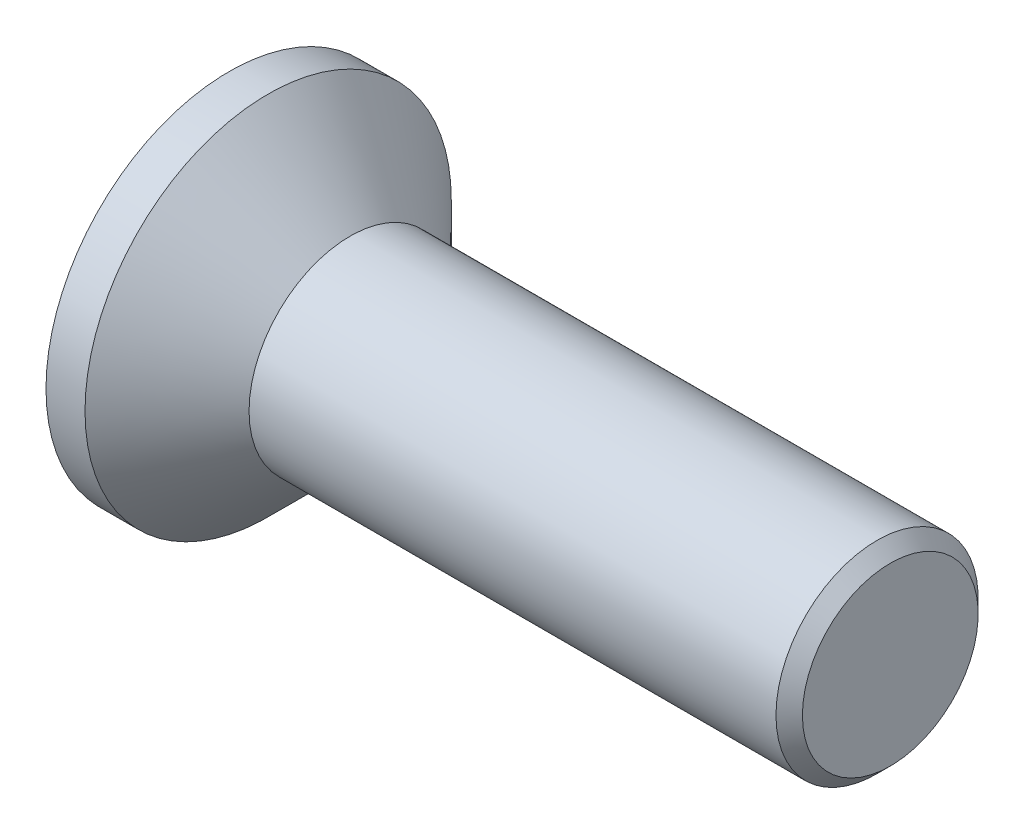
ISO-10303-21;
HEADER;
FILE_DESCRIPTION(('STEP AP214'),'2;1');
FILE_NAME('part.step','',(''),(''),'','','');
FILE_SCHEMA(('AUTOMOTIVE_DESIGN { 1 0 10303 214 1 1 1 1 }'));
ENDSEC;
DATA;
#1=APPLICATION_CONTEXT('core data for automotive mechanical design processes');
#2=APPLICATION_PROTOCOL_DEFINITION('international standard','automotive_design',2000,#1);
#3=PRODUCT_CONTEXT('',#1,'mechanical');
#4=PRODUCT('Part','Part','',(#3));
#5=PRODUCT_RELATED_PRODUCT_CATEGORY('part','',(#4));
#6=PRODUCT_DEFINITION_FORMATION('','',#4);
#7=PRODUCT_DEFINITION_CONTEXT('part definition',#1,'design');
#8=PRODUCT_DEFINITION('design','',#6,#7);
#9=PRODUCT_DEFINITION_SHAPE('','',#8);
#10=(LENGTH_UNIT() NAMED_UNIT(*) SI_UNIT(.MILLI.,.METRE.));
#11=(NAMED_UNIT(*) PLANE_ANGLE_UNIT() SI_UNIT($,.RADIAN.));
#12=(NAMED_UNIT(*) SI_UNIT($,.STERADIAN.) SOLID_ANGLE_UNIT());
#13=UNCERTAINTY_MEASURE_WITH_UNIT(LENGTH_MEASURE(1.E-05),#10,'distance_accuracy_value','');
#14=(GEOMETRIC_REPRESENTATION_CONTEXT(3) GLOBAL_UNCERTAINTY_ASSIGNED_CONTEXT((#13)) GLOBAL_UNIT_ASSIGNED_CONTEXT((#10,
#11,#12)) REPRESENTATION_CONTEXT('',''));
#15=CARTESIAN_POINT('',(0.,0.,0.));
#16=DIRECTION('',(0.,0.,1.));
#17=DIRECTION('',(1.,0.,0.));
#18=AXIS2_PLACEMENT_3D('',#15,#16,#17);
#19=CARTESIAN_POINT('',(1.09999999999999,0.,0.));
#20=DIRECTION('',(-1.,0.,0.));
#21=DIRECTION('',(0.,0.,1.));
#22=AXIS2_PLACEMENT_3D('',#19,#20,#21);
#23=CONICAL_SURFACE('',#22,0.99999999999989,1.04719755119658);
#24=CARTESIAN_POINT('',(1.67735026918958,0.,0.));
#25=VERTEX_POINT('',#24);
#26=VERTEX_LOOP('',#25);
#27=FACE_BOUND('',#26,.T.);
#28=CARTESIAN_POINT('',(1.09999999999999,0.,0.));
#29=DIRECTION('',(-1.,0.,0.));
#30=DIRECTION('',(0.,0.,1.));
#31=AXIS2_PLACEMENT_3D('',#28,#29,#30);
#32=CIRCLE('',#31,0.99999999999989);
#33=CARTESIAN_POINT('',(1.09999999999999,-0.499999999999972,0.86602540378439));
#34=VERTEX_POINT('',#33);
#35=CARTESIAN_POINT('',(1.09999999999999,0.499999999999972,0.866025403784391));
#36=VERTEX_POINT('',#35);
#37=EDGE_CURVE('E91',#34,#36,#32,.T.);
#38=ORIENTED_EDGE('',*,*,#37,.T.);
#39=CARTESIAN_POINT('',(1.09999999999999,0.,0.));
#40=DIRECTION('',(-1.,0.,0.));
#41=DIRECTION('',(0.,0.,1.));
#42=AXIS2_PLACEMENT_3D('',#39,#40,#41);
#43=CIRCLE('',#42,0.99999999999989);
#44=CARTESIAN_POINT('',(1.09999999999999,0.999999999999945,0.));
#45=VERTEX_POINT('',#44);
#46=EDGE_CURVE('E105',#36,#45,#43,.T.);
#47=ORIENTED_EDGE('',*,*,#46,.T.);
#48=CARTESIAN_POINT('',(1.09999999999999,0.,0.));
#49=DIRECTION('',(-1.,0.,0.));
#50=DIRECTION('',(0.,0.,1.));
#51=AXIS2_PLACEMENT_3D('',#48,#49,#50);
#52=CIRCLE('',#51,0.99999999999989);
#53=CARTESIAN_POINT('',(1.09999999999999,0.499999999999972,-0.866025403784391));
#54=VERTEX_POINT('',#53);
#55=EDGE_CURVE('E148',#45,#54,#52,.T.);
#56=ORIENTED_EDGE('',*,*,#55,.T.);
#57=CARTESIAN_POINT('',(1.09999999999999,0.,0.));
#58=DIRECTION('',(-1.,0.,0.));
#59=DIRECTION('',(0.,0.,1.));
#60=AXIS2_PLACEMENT_3D('',#57,#58,#59);
#61=CIRCLE('',#60,0.99999999999989);
#62=CARTESIAN_POINT('',(1.09999999999999,-0.499999999999973,-0.866025403784392));
#63=VERTEX_POINT('',#62);
#64=EDGE_CURVE('E135',#54,#63,#61,.T.);
#65=ORIENTED_EDGE('',*,*,#64,.T.);
#66=CARTESIAN_POINT('',(1.09999999999999,0.,0.));
#67=DIRECTION('',(-1.,0.,0.));
#68=DIRECTION('',(0.,0.,1.));
#69=AXIS2_PLACEMENT_3D('',#66,#67,#68);
#70=CIRCLE('',#69,0.99999999999989);
#71=CARTESIAN_POINT('',(1.09999999999999,-0.999999999999945,0.));
#72=VERTEX_POINT('',#71);
#73=EDGE_CURVE('E88',#63,#72,#70,.T.);
#74=ORIENTED_EDGE('',*,*,#73,.T.);
#75=CARTESIAN_POINT('',(1.09999999999999,0.,0.));
#76=DIRECTION('',(-1.,0.,0.));
#77=DIRECTION('',(0.,0.,1.));
#78=AXIS2_PLACEMENT_3D('',#75,#76,#77);
#79=CIRCLE('',#78,0.99999999999989);
#80=EDGE_CURVE('E19',#72,#34,#79,.T.);
#81=ORIENTED_EDGE('',*,*,#80,.T.);
#82=EDGE_LOOP('',(#38,#47,#56,#65,#74,#81));
#83=FACE_BOUND('',#82,.T.);
#84=ADVANCED_FACE('F16',(#27,#83),#23,.F.);
#85=CARTESIAN_POINT('',(1.1,0.,-1.15470053837925));
#86=DIRECTION('',(1.,0.,0.));
#87=DIRECTION('',(0.,0.,-1.));
#88=AXIS2_PLACEMENT_3D('',#85,#86,#87);
#89=PLANE('',#88);
#90=DIRECTION('',(0.,0.,1.));
#91=VECTOR('',#90,1.);
#92=CARTESIAN_POINT('',(1.1,-1.,0.577350269189625));
#93=LINE('',#92,#91);
#94=CARTESIAN_POINT('',(1.1,-1.,0.577350269189624));
#95=VERTEX_POINT('',#94);
#96=EDGE_CURVE('E110',#95,#72,#93,.F.);
#97=ORIENTED_EDGE('',*,*,#96,.F.);
#98=DIRECTION('',(0.,0.866025403784439,0.5));
#99=VECTOR('',#98,1.);
#100=CARTESIAN_POINT('',(1.1,0.,1.15470053837925));
#101=LINE('',#100,#99);
#102=EDGE_CURVE('E107',#34,#95,#101,.F.);
#103=ORIENTED_EDGE('',*,*,#102,.F.);
#104=ORIENTED_EDGE('',*,*,#80,.F.);
#105=EDGE_LOOP('',(#97,#103,#104));
#106=FACE_BOUND('',#105,.T.);
#107=ADVANCED_FACE('F108',(#106),#89,.F.);
#108=CARTESIAN_POINT('',(1.1,0.,-1.15470053837925));
#109=DIRECTION('',(1.,0.,0.));
#110=DIRECTION('',(0.,0.,-1.));
#111=AXIS2_PLACEMENT_3D('',#108,#109,#110);
#112=PLANE('',#111);
#113=DIRECTION('',(0.,0.866025403784439,0.5));
#114=VECTOR('',#113,1.);
#115=CARTESIAN_POINT('',(1.1,0.,1.15470053837925));
#116=LINE('',#115,#114);
#117=CARTESIAN_POINT('',(1.1,0.,1.15470053837925));
#118=VERTEX_POINT('',#117);
#119=EDGE_CURVE('E100',#118,#34,#116,.F.);
#120=ORIENTED_EDGE('',*,*,#119,.F.);
#121=DIRECTION('',(0.,0.866025403784439,-0.5));
#122=VECTOR('',#121,1.);
#123=CARTESIAN_POINT('',(1.1,1.,0.577350269189625));
#124=LINE('',#123,#122);
#125=EDGE_CURVE('E103',#36,#118,#124,.F.);
#126=ORIENTED_EDGE('',*,*,#125,.F.);
#127=ORIENTED_EDGE('',*,*,#37,.F.);
#128=EDGE_LOOP('',(#120,#126,#127));
#129=FACE_BOUND('',#128,.T.);
#130=ADVANCED_FACE('F98',(#129),#112,.F.);
#131=CARTESIAN_POINT('',(1.1,0.,-1.15470053837925));
#132=DIRECTION('',(1.,0.,0.));
#133=DIRECTION('',(0.,0.,-1.));
#134=AXIS2_PLACEMENT_3D('',#131,#132,#133);
#135=PLANE('',#134);
#136=DIRECTION('',(0.,0.866025403784439,-0.5));
#137=VECTOR('',#136,1.);
#138=CARTESIAN_POINT('',(1.1,1.,0.577350269189625));
#139=LINE('',#138,#137);
#140=CARTESIAN_POINT('',(1.1,1.,0.577350269189625));
#141=VERTEX_POINT('',#140);
#142=EDGE_CURVE('E131',#141,#36,#139,.F.);
#143=ORIENTED_EDGE('',*,*,#142,.F.);
#144=DIRECTION('',(0.,0.,-1.));
#145=VECTOR('',#144,1.);
#146=CARTESIAN_POINT('',(1.1,1.,-0.577350269189625));
#147=LINE('',#146,#145);
#148=EDGE_CURVE('E164',#45,#141,#147,.F.);
#149=ORIENTED_EDGE('',*,*,#148,.F.);
#150=ORIENTED_EDGE('',*,*,#46,.F.);
#151=EDGE_LOOP('',(#143,#149,#150));
#152=FACE_BOUND('',#151,.T.);
#153=ADVANCED_FACE('F165',(#152),#135,.F.);
#154=CARTESIAN_POINT('',(1.1,0.,-1.15470053837925));
#155=DIRECTION('',(1.,0.,0.));
#156=DIRECTION('',(0.,0.,-1.));
#157=AXIS2_PLACEMENT_3D('',#154,#155,#156);
#158=PLANE('',#157);
#159=DIRECTION('',(0.,0.,-1.));
#160=VECTOR('',#159,1.);
#161=CARTESIAN_POINT('',(1.1,1.,-0.577350269189625));
#162=LINE('',#161,#160);
#163=CARTESIAN_POINT('',(1.1,1.,-0.577350269189625));
#164=VERTEX_POINT('',#163);
#165=EDGE_CURVE('E158',#164,#45,#162,.F.);
#166=ORIENTED_EDGE('',*,*,#165,.F.);
#167=DIRECTION('',(0.,-0.866025403784439,-0.5));
#168=VECTOR('',#167,1.);
#169=CARTESIAN_POINT('',(1.1,0.,-1.15470053837925));
#170=LINE('',#169,#168);
#171=EDGE_CURVE('E161',#54,#164,#170,.F.);
#172=ORIENTED_EDGE('',*,*,#171,.F.);
#173=ORIENTED_EDGE('',*,*,#55,.F.);
#174=EDGE_LOOP('',(#166,#172,#173));
#175=FACE_BOUND('',#174,.T.);
#176=ADVANCED_FACE('F156',(#175),#158,.F.);
#177=CARTESIAN_POINT('',(1.1,0.,-1.15470053837925));
#178=DIRECTION('',(1.,0.,0.));
#179=DIRECTION('',(0.,0.,-1.));
#180=AXIS2_PLACEMENT_3D('',#177,#178,#179);
#181=PLANE('',#180);
#182=DIRECTION('',(0.,-0.866025403784439,0.5));
#183=VECTOR('',#182,1.);
#184=CARTESIAN_POINT('',(1.1,-1.,-0.577350269189628));
#185=LINE('',#184,#183);
#186=CARTESIAN_POINT('',(1.1,-1.,-0.577350269189628));
#187=VERTEX_POINT('',#186);
#188=EDGE_CURVE('E210',#187,#63,#185,.F.);
#189=ORIENTED_EDGE('',*,*,#188,.F.);
#190=DIRECTION('',(0.,0.,1.));
#191=VECTOR('',#190,1.);
#192=CARTESIAN_POINT('',(1.1,-1.,0.577350269189625));
#193=LINE('',#192,#191);
#194=EDGE_CURVE('E119',#72,#187,#193,.F.);
#195=ORIENTED_EDGE('',*,*,#194,.F.);
#196=ORIENTED_EDGE('',*,*,#73,.F.);
#197=EDGE_LOOP('',(#189,#195,#196));
#198=FACE_BOUND('',#197,.T.);
#199=ADVANCED_FACE('F249',(#198),#181,.F.);
#200=CARTESIAN_POINT('',(1.1,0.,-1.15470053837925));
#201=DIRECTION('',(1.,0.,0.));
#202=DIRECTION('',(0.,0.,-1.));
#203=AXIS2_PLACEMENT_3D('',#200,#201,#202);
#204=PLANE('',#203);
#205=DIRECTION('',(0.,-0.866025403784439,-0.5));
#206=VECTOR('',#205,1.);
#207=CARTESIAN_POINT('',(1.1,0.,-1.15470053837925));
#208=LINE('',#207,#206);
#209=CARTESIAN_POINT('',(1.1,0.,-1.15470053837925));
#210=VERTEX_POINT('',#209);
#211=EDGE_CURVE('E183',#210,#54,#208,.F.);
#212=ORIENTED_EDGE('',*,*,#211,.F.);
#213=DIRECTION('',(0.,-0.866025403784439,0.5));
#214=VECTOR('',#213,1.);
#215=CARTESIAN_POINT('',(1.1,-1.,-0.577350269189628));
#216=LINE('',#215,#214);
#217=EDGE_CURVE('E213',#63,#210,#216,.F.);
#218=ORIENTED_EDGE('',*,*,#217,.F.);
#219=ORIENTED_EDGE('',*,*,#64,.F.);
#220=EDGE_LOOP('',(#212,#218,#219));
#221=FACE_BOUND('',#220,.T.);
#222=ADVANCED_FACE('F246',(#221),#204,.F.);
#223=CARTESIAN_POINT('',(1.1,-1.,0.577350269189625));
#224=DIRECTION('',(0.,1.,0.));
#225=DIRECTION('',(0.,0.,1.));
#226=AXIS2_PLACEMENT_3D('',#223,#224,#225);
#227=PLANE('',#226);
#228=ORIENTED_EDGE('',*,*,#194,.T.);
#229=DIRECTION('',(1.,0.,0.));
#230=VECTOR('',#229,1.);
#231=CARTESIAN_POINT('',(1.1,-1.,-0.577350269189628));
#232=LINE('',#231,#230);
#233=CARTESIAN_POINT('',(0.,-1.,-0.577350269189628));
#234=VERTEX_POINT('',#233);
#235=EDGE_CURVE('E214',#234,#187,#232,.T.);
#236=ORIENTED_EDGE('',*,*,#235,.F.);
#237=DIRECTION('',(0.,0.,-1.));
#238=VECTOR('',#237,1.);
#239=CARTESIAN_POINT('',(0.,-1.,0.));
#240=LINE('',#239,#238);
#241=CARTESIAN_POINT('',(0.,-1.,0.577350269189625));
#242=VERTEX_POINT('',#241);
#243=EDGE_CURVE('E209',#234,#242,#240,.F.);
#244=ORIENTED_EDGE('',*,*,#243,.T.);
#245=DIRECTION('',(1.,0.,0.));
#246=VECTOR('',#245,1.);
#247=CARTESIAN_POINT('',(1.1,-1.,0.577350269189624));
#248=LINE('',#247,#246);
#249=EDGE_CURVE('E114',#95,#242,#248,.F.);
#250=ORIENTED_EDGE('',*,*,#249,.F.);
#251=ORIENTED_EDGE('',*,*,#96,.T.);
#252=EDGE_LOOP('',(#228,#236,#244,#250,#251));
#253=FACE_BOUND('',#252,.T.);
#254=ADVANCED_FACE('F251',(#253),#227,.T.);
#255=CARTESIAN_POINT('',(1.1,0.,1.15470053837925));
#256=DIRECTION('',(0.,0.5,-0.866025403784439));
#257=DIRECTION('',(0.,0.866025403784439,0.5));
#258=AXIS2_PLACEMENT_3D('',#255,#256,#257);
#259=PLANE('',#258);
#260=ORIENTED_EDGE('',*,*,#102,.T.);
#261=ORIENTED_EDGE('',*,*,#249,.T.);
#262=DIRECTION('',(0.,0.866025403784439,0.499999999999999));
#263=VECTOR('',#262,1.);
#264=CARTESIAN_POINT('',(0.,-1.,0.577350269189625));
#265=LINE('',#264,#263);
#266=CARTESIAN_POINT('',(0.,0.,1.15470053837925));
#267=VERTEX_POINT('',#266);
#268=EDGE_CURVE('E204',#242,#267,#265,.T.);
#269=ORIENTED_EDGE('',*,*,#268,.T.);
#270=DIRECTION('',(1.,0.,0.));
#271=VECTOR('',#270,1.);
#272=CARTESIAN_POINT('',(1.1,0.,1.15470053837925));
#273=LINE('',#272,#271);
#274=EDGE_CURVE('E118',#118,#267,#273,.F.);
#275=ORIENTED_EDGE('',*,*,#274,.F.);
#276=ORIENTED_EDGE('',*,*,#119,.T.);
#277=EDGE_LOOP('',(#260,#261,#269,#275,#276));
#278=FACE_BOUND('',#277,.T.);
#279=ADVANCED_FACE('F116',(#278),#259,.T.);
#280=CARTESIAN_POINT('',(1.1,1.,0.577350269189625));
#281=DIRECTION('',(0.,-0.5,-0.866025403784439));
#282=DIRECTION('',(0.,0.866025403784439,-0.5));
#283=AXIS2_PLACEMENT_3D('',#280,#281,#282);
#284=PLANE('',#283);
#285=ORIENTED_EDGE('',*,*,#125,.T.);
#286=ORIENTED_EDGE('',*,*,#274,.T.);
#287=DIRECTION('',(0.,0.866025403784439,-0.5));
#288=VECTOR('',#287,1.);
#289=CARTESIAN_POINT('',(0.,0.,1.15470053837925));
#290=LINE('',#289,#288);
#291=CARTESIAN_POINT('',(0.,1.,0.577350269189625));
#292=VERTEX_POINT('',#291);
#293=EDGE_CURVE('E194',#267,#292,#290,.T.);
#294=ORIENTED_EDGE('',*,*,#293,.T.);
#295=DIRECTION('',(1.,0.,0.));
#296=VECTOR('',#295,1.);
#297=CARTESIAN_POINT('',(1.1,1.,0.577350269189625));
#298=LINE('',#297,#296);
#299=EDGE_CURVE('E169',#141,#292,#298,.F.);
#300=ORIENTED_EDGE('',*,*,#299,.F.);
#301=ORIENTED_EDGE('',*,*,#142,.T.);
#302=EDGE_LOOP('',(#285,#286,#294,#300,#301));
#303=FACE_BOUND('',#302,.T.);
#304=ADVANCED_FACE('F192',(#303),#284,.T.);
#305=CARTESIAN_POINT('',(1.1,1.,-0.577350269189625));
#306=DIRECTION('',(0.,-1.,0.));
#307=DIRECTION('',(0.,0.,-1.));
#308=AXIS2_PLACEMENT_3D('',#305,#306,#307);
#309=PLANE('',#308);
#310=ORIENTED_EDGE('',*,*,#148,.T.);
#311=ORIENTED_EDGE('',*,*,#299,.T.);
#312=DIRECTION('',(0.,0.,-1.));
#313=VECTOR('',#312,1.);
#314=CARTESIAN_POINT('',(0.,1.,0.));
#315=LINE('',#314,#313);
#316=CARTESIAN_POINT('',(0.,1.,-0.577350269189625));
#317=VERTEX_POINT('',#316);
#318=EDGE_CURVE('E196',#292,#317,#315,.T.);
#319=ORIENTED_EDGE('',*,*,#318,.T.);
#320=DIRECTION('',(1.,0.,0.));
#321=VECTOR('',#320,1.);
#322=CARTESIAN_POINT('',(1.1,1.,-0.577350269189626));
#323=LINE('',#322,#321);
#324=EDGE_CURVE('E172',#164,#317,#323,.F.);
#325=ORIENTED_EDGE('',*,*,#324,.F.);
#326=ORIENTED_EDGE('',*,*,#165,.T.);
#327=EDGE_LOOP('',(#310,#311,#319,#325,#326));
#328=FACE_BOUND('',#327,.T.);
#329=ADVANCED_FACE('F171',(#328),#309,.T.);
#330=CARTESIAN_POINT('',(1.1,0.,-1.15470053837925));
#331=DIRECTION('',(0.,-0.5,0.866025403784439));
#332=DIRECTION('',(0.,-0.866025403784439,-0.5));
#333=AXIS2_PLACEMENT_3D('',#330,#331,#332);
#334=PLANE('',#333);
#335=ORIENTED_EDGE('',*,*,#171,.T.);
#336=ORIENTED_EDGE('',*,*,#324,.T.);
#337=DIRECTION('',(0.,-0.866025403784438,-0.5));
#338=VECTOR('',#337,1.);
#339=CARTESIAN_POINT('',(0.,1.,-0.577350269189625));
#340=LINE('',#339,#338);
#341=CARTESIAN_POINT('',(0.,0.,-1.15470053837925));
#342=VERTEX_POINT('',#341);
#343=EDGE_CURVE('E34',#317,#342,#340,.T.);
#344=ORIENTED_EDGE('',*,*,#343,.T.);
#345=DIRECTION('',(1.,0.,0.));
#346=VECTOR('',#345,1.);
#347=CARTESIAN_POINT('',(1.1,0.,-1.15470053837925));
#348=LINE('',#347,#346);
#349=EDGE_CURVE('E219',#210,#342,#348,.F.);
#350=ORIENTED_EDGE('',*,*,#349,.F.);
#351=ORIENTED_EDGE('',*,*,#211,.T.);
#352=EDGE_LOOP('',(#335,#336,#344,#350,#351));
#353=FACE_BOUND('',#352,.T.);
#354=ADVANCED_FACE('F243',(#353),#334,.T.);
#355=CARTESIAN_POINT('',(1.1,-1.,-0.577350269189628));
#356=DIRECTION('',(0.,0.5,0.866025403784439));
#357=DIRECTION('',(0.,-0.866025403784439,0.5));
#358=AXIS2_PLACEMENT_3D('',#355,#356,#357);
#359=PLANE('',#358);
#360=ORIENTED_EDGE('',*,*,#217,.T.);
#361=ORIENTED_EDGE('',*,*,#349,.T.);
#362=DIRECTION('',(0.,-0.866025403784439,0.5));
#363=VECTOR('',#362,1.);
#364=CARTESIAN_POINT('',(0.,0.,-1.15470053837925));
#365=LINE('',#364,#363);
#366=EDGE_CURVE('E145',#342,#234,#365,.T.);
#367=ORIENTED_EDGE('',*,*,#366,.T.);
#368=ORIENTED_EDGE('',*,*,#235,.T.);
#369=ORIENTED_EDGE('',*,*,#188,.T.);
#370=EDGE_LOOP('',(#360,#361,#367,#368,#369));
#371=FACE_BOUND('',#370,.T.);
#372=ADVANCED_FACE('F254',(#371),#359,.T.);
#373=CARTESIAN_POINT('',(0.,0.,0.));
#374=DIRECTION('',(1.,0.,0.));
#375=DIRECTION('',(0.,0.,-1.));
#376=AXIS2_PLACEMENT_3D('',#373,#374,#375);
#377=PLANE('',#376);
#378=ORIENTED_EDGE('',*,*,#343,.F.);
#379=ORIENTED_EDGE('',*,*,#318,.F.);
#380=ORIENTED_EDGE('',*,*,#293,.F.);
#381=ORIENTED_EDGE('',*,*,#268,.F.);
#382=ORIENTED_EDGE('',*,*,#243,.F.);
#383=ORIENTED_EDGE('',*,*,#366,.F.);
#384=EDGE_LOOP('',(#378,#379,#380,#381,#382,#383));
#385=FACE_BOUND('',#384,.T.);
#386=CARTESIAN_POINT('',(0.,0.,0.));
#387=DIRECTION('',(1.,0.,0.));
#388=DIRECTION('',(0.,0.,-1.));
#389=AXIS2_PLACEMENT_3D('',#386,#387,#388);
#390=CIRCLE('',#389,2.77);
#391=CARTESIAN_POINT('',(0.,0.,-2.77));
#392=VERTEX_POINT('',#391);
#393=EDGE_CURVE('E142',#392,#392,#390,.T.);
#394=ORIENTED_EDGE('',*,*,#393,.F.);
#395=EDGE_LOOP('',(#394));
#396=FACE_BOUND('',#395,.T.);
#397=ADVANCED_FACE('F198',(#385,#396),#377,.F.);
#398=CARTESIAN_POINT('',(10.0007106781187,0.,0.));
#399=DIRECTION('',(-1.,0.,0.));
#400=DIRECTION('',(0.,0.,1.));
#401=AXIS2_PLACEMENT_3D('',#398,#399,#400);
#402=PLANE('',#401);
#403=CARTESIAN_POINT('',(10.0007106781845,0.,0.));
#404=DIRECTION('',(-1.,0.,0.));
#405=DIRECTION('',(0.,0.,1.));
#406=AXIS2_PLACEMENT_3D('',#403,#404,#405);
#407=CIRCLE('',#406,1.32928932191589);
#408=CARTESIAN_POINT('',(10.0007106781845,0.,1.32928932191589));
#409=VERTEX_POINT('',#408);
#410=EDGE_CURVE('E138',#409,#409,#407,.T.);
#411=ORIENTED_EDGE('',*,*,#410,.F.);
#412=EDGE_LOOP('',(#411));
#413=FACE_BOUND('',#412,.T.);
#414=ADVANCED_FACE('F262',(#413),#402,.F.);
#415=CARTESIAN_POINT('',(11.8531386861314,0.,0.));
#416=DIRECTION('',(1.,0.,0.));
#417=DIRECTION('',(0.,0.,-1.));
#418=AXIS2_PLACEMENT_3D('',#415,#416,#417);
#419=CYLINDRICAL_SURFACE('',#418,2.77);
#420=CARTESIAN_POINT('',(0.589999999988322,0.,0.));
#421=DIRECTION('',(-1.,0.,0.));
#422=DIRECTION('',(0.,0.,-1.));
#423=AXIS2_PLACEMENT_3D('',#420,#421,#422);
#424=CIRCLE('',#423,2.77000000005501);
#425=CARTESIAN_POINT('',(0.589999999988322,0.,-2.77000000005501));
#426=VERTEX_POINT('',#425);
#427=EDGE_CURVE('E141',#426,#426,#424,.F.);
#428=ORIENTED_EDGE('',*,*,#427,.F.);
#429=EDGE_LOOP('',(#428));
#430=FACE_BOUND('',#429,.T.);
#431=ORIENTED_EDGE('',*,*,#393,.T.);
#432=EDGE_LOOP('',(#431));
#433=FACE_BOUND('',#432,.T.);
#434=ADVANCED_FACE('F280',(#430,#433),#419,.T.);
#435=CARTESIAN_POINT('',(9.80071067817789,0.,0.));
#436=DIRECTION('',(-1.,0.,0.));
#437=DIRECTION('',(0.,0.,1.));
#438=AXIS2_PLACEMENT_3D('',#435,#436,#437);
#439=CONICAL_SURFACE('',#438,1.52928932186569,0.78539816325534);
#440=CARTESIAN_POINT('',(9.80071067811865,0.,0.));
#441=DIRECTION('',(-1.,0.,0.));
#442=DIRECTION('',(0.,0.,1.));
#443=AXIS2_PLACEMENT_3D('',#440,#441,#442);
#444=CIRCLE('',#443,1.52928932188135);
#445=CARTESIAN_POINT('',(9.80071067811865,0.,1.52928932188135));
#446=VERTEX_POINT('',#445);
#447=EDGE_CURVE('E25',#446,#446,#444,.T.);
#448=ORIENTED_EDGE('',*,*,#447,.F.);
#449=EDGE_LOOP('',(#448));
#450=FACE_BOUND('',#449,.T.);
#451=ORIENTED_EDGE('',*,*,#410,.T.);
#452=EDGE_LOOP('',(#451));
#453=FACE_BOUND('',#452,.T.);
#454=ADVANCED_FACE('F273',(#450,#453),#439,.T.);
#455=CARTESIAN_POINT('',(0.589999999931479,0.,0.));
#456=DIRECTION('',(-1.,0.,0.));
#457=DIRECTION('',(0.,0.,1.));
#458=AXIS2_PLACEMENT_3D('',#455,#456,#457);
#459=CONICAL_SURFACE('',#458,2.77000000011185,0.785398163397448);
#460=ORIENTED_EDGE('',*,*,#427,.T.);
#461=EDGE_LOOP('',(#460));
#462=FACE_BOUND('',#461,.T.);
#463=CARTESIAN_POINT('',(1.83071067811866,0.,0.));
#464=DIRECTION('',(-1.,0.,0.));
#465=DIRECTION('',(0.,0.,1.));
#466=AXIS2_PLACEMENT_3D('',#463,#464,#465);
#467=CIRCLE('',#466,1.52928932188135);
#468=CARTESIAN_POINT('',(1.83071067811866,0.,1.52928932188135));
#469=VERTEX_POINT('',#468);
#470=EDGE_CURVE('E11',#469,#469,#467,.F.);
#471=ORIENTED_EDGE('',*,*,#470,.F.);
#472=EDGE_LOOP('',(#471));
#473=FACE_BOUND('',#472,.T.);
#474=ADVANCED_FACE('F267',(#462,#473),#459,.T.);
#475=CARTESIAN_POINT('',(10.0007106781187,0.,0.));
#476=DIRECTION('',(-1.,0.,0.));
#477=DIRECTION('',(0.,0.,1.));
#478=AXIS2_PLACEMENT_3D('',#475,#476,#477);
#479=CYLINDRICAL_SURFACE('',#478,1.52928932188135);
#480=ORIENTED_EDGE('',*,*,#470,.T.);
#481=EDGE_LOOP('',(#480));
#482=FACE_BOUND('',#481,.T.);
#483=ORIENTED_EDGE('',*,*,#447,.T.);
#484=EDGE_LOOP('',(#483));
#485=FACE_BOUND('',#484,.T.);
#486=ADVANCED_FACE('F265',(#482,#485),#479,.T.);
#487=CLOSED_SHELL('',(#84,#107,#130,#153,#176,#199,#222,#254,#279,#304,#329,#354,#372,#397,#414,
#434,#454,#474,#486));
#488=MANIFOLD_SOLID_BREP('B1',#487);
#489=ADVANCED_BREP_SHAPE_REPRESENTATION('',(#18,#488),#14);
#490=SHAPE_DEFINITION_REPRESENTATION(#9,#489);
ENDSEC;
END-ISO-10303-21;
